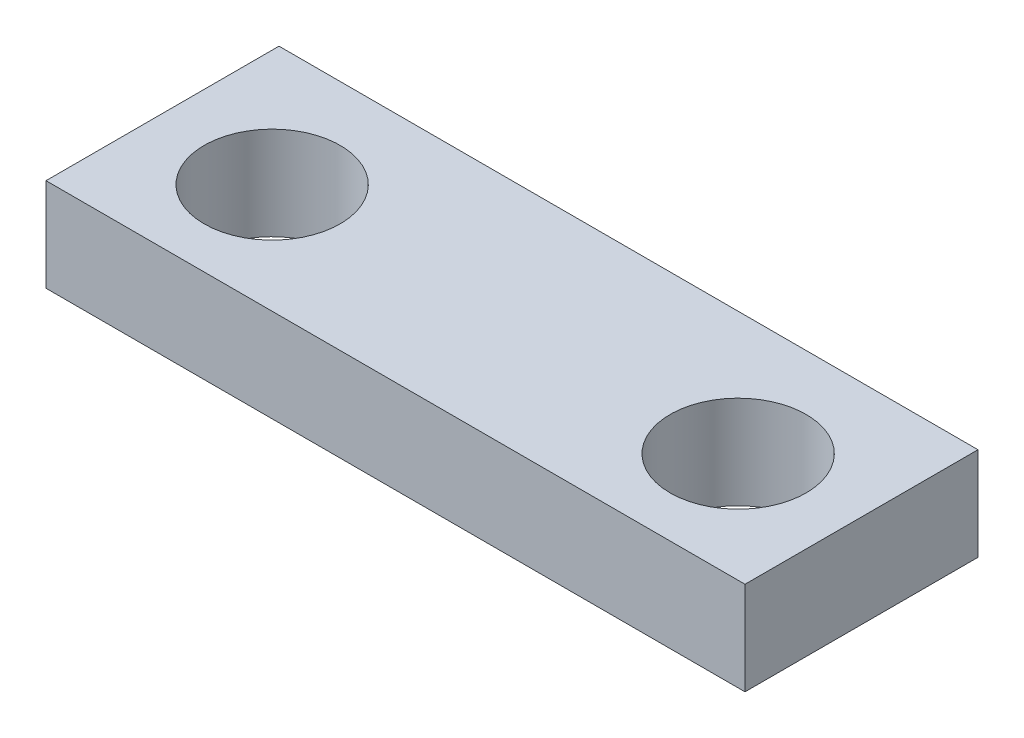
ISO-10303-21;
HEADER;
FILE_DESCRIPTION(('STEP AP214'),'2;1');
FILE_NAME('part.step','',(''),(''),'','','');
FILE_SCHEMA(('AUTOMOTIVE_DESIGN { 1 0 10303 214 1 1 1 1 }'));
ENDSEC;
DATA;
#1=APPLICATION_CONTEXT('core data for automotive mechanical design processes');
#2=APPLICATION_PROTOCOL_DEFINITION('international standard','automotive_design',2000,#1);
#3=PRODUCT_CONTEXT('',#1,'mechanical');
#4=PRODUCT('Part','Part','',(#3));
#5=PRODUCT_RELATED_PRODUCT_CATEGORY('part','',(#4));
#6=PRODUCT_DEFINITION_FORMATION('','',#4);
#7=PRODUCT_DEFINITION_CONTEXT('part definition',#1,'design');
#8=PRODUCT_DEFINITION('design','',#6,#7);
#9=PRODUCT_DEFINITION_SHAPE('','',#8);
#10=(LENGTH_UNIT() NAMED_UNIT(*) SI_UNIT(.MILLI.,.METRE.));
#11=(NAMED_UNIT(*) PLANE_ANGLE_UNIT() SI_UNIT($,.RADIAN.));
#12=(NAMED_UNIT(*) SI_UNIT($,.STERADIAN.) SOLID_ANGLE_UNIT());
#13=UNCERTAINTY_MEASURE_WITH_UNIT(LENGTH_MEASURE(1.E-05),#10,'distance_accuracy_value','');
#14=(GEOMETRIC_REPRESENTATION_CONTEXT(3) GLOBAL_UNCERTAINTY_ASSIGNED_CONTEXT((#13)) GLOBAL_UNIT_ASSIGNED_CONTEXT((#10,
#11,#12)) REPRESENTATION_CONTEXT('',''));
#15=CARTESIAN_POINT('',(0.,0.,0.));
#16=DIRECTION('',(0.,0.,1.));
#17=DIRECTION('',(1.,0.,0.));
#18=AXIS2_PLACEMENT_3D('',#15,#16,#17);
#19=CARTESIAN_POINT('',(7.94117647058824,-2.,0.));
#20=DIRECTION('',(-1.,0.,0.));
#21=DIRECTION('',(0.,0.,1.));
#22=AXIS2_PLACEMENT_3D('',#19,#20,#21);
#23=PLANE('',#22);
#24=DIRECTION('',(0.,0.,1.));
#25=VECTOR('',#24,1.);
#26=CARTESIAN_POINT('',(7.94117647058824,0.,0.));
#27=LINE('',#26,#25);
#28=CARTESIAN_POINT('',(7.94117647058824,0.,-1.76470588235294));
#29=VERTEX_POINT('',#28);
#30=CARTESIAN_POINT('',(7.94117647058824,0.,3.23529411764706));
#31=VERTEX_POINT('',#30);
#32=EDGE_CURVE('E118',#29,#31,#27,.T.);
#33=ORIENTED_EDGE('',*,*,#32,.T.);
#34=DIRECTION('',(0.,1.,0.));
#35=VECTOR('',#34,1.);
#36=CARTESIAN_POINT('',(7.94117647058824,-2.,3.23529411764706));
#37=LINE('',#36,#35);
#38=CARTESIAN_POINT('',(7.94117647058824,-2.,3.23529411764706));
#39=VERTEX_POINT('',#38);
#40=EDGE_CURVE('E11',#39,#31,#37,.T.);
#41=ORIENTED_EDGE('',*,*,#40,.F.);
#42=DIRECTION('',(0.,0.,1.));
#43=VECTOR('',#42,1.);
#44=CARTESIAN_POINT('',(7.94117647058824,-2.,0.));
#45=LINE('',#44,#43);
#46=CARTESIAN_POINT('',(7.94117647058824,-2.,-1.76470588235294));
#47=VERTEX_POINT('',#46);
#48=EDGE_CURVE('E61',#47,#39,#45,.T.);
#49=ORIENTED_EDGE('',*,*,#48,.F.);
#50=DIRECTION('',(0.,1.,0.));
#51=VECTOR('',#50,1.);
#52=CARTESIAN_POINT('',(7.94117647058824,-2.,-1.76470588235294));
#53=LINE('',#52,#51);
#54=EDGE_CURVE('E45',#47,#29,#53,.T.);
#55=ORIENTED_EDGE('',*,*,#54,.T.);
#56=EDGE_LOOP('',(#33,#41,#49,#55));
#57=FACE_BOUND('',#56,.T.);
#58=ADVANCED_FACE('F41',(#57),#23,.F.);
#59=CARTESIAN_POINT('',(0.,-2.,3.23529411764706));
#60=DIRECTION('',(0.,0.,1.));
#61=DIRECTION('',(1.,0.,0.));
#62=AXIS2_PLACEMENT_3D('',#59,#60,#61);
#63=PLANE('',#62);
#64=DIRECTION('',(1.,0.,0.));
#65=VECTOR('',#64,1.);
#66=CARTESIAN_POINT('',(0.,0.,3.23529411764706));
#67=LINE('',#66,#65);
#68=CARTESIAN_POINT('',(-7.05882352941176,0.,3.23529411764706));
#69=VERTEX_POINT('',#68);
#70=EDGE_CURVE('E126',#69,#31,#67,.T.);
#71=ORIENTED_EDGE('',*,*,#70,.F.);
#72=DIRECTION('',(0.,1.,0.));
#73=VECTOR('',#72,1.);
#74=CARTESIAN_POINT('',(-7.05882352941176,-2.,3.23529411764706));
#75=LINE('',#74,#73);
#76=CARTESIAN_POINT('',(-7.05882352941176,-2.,3.23529411764706));
#77=VERTEX_POINT('',#76);
#78=EDGE_CURVE('E52',#77,#69,#75,.T.);
#79=ORIENTED_EDGE('',*,*,#78,.F.);
#80=DIRECTION('',(1.,0.,0.));
#81=VECTOR('',#80,1.);
#82=CARTESIAN_POINT('',(0.,-2.,3.23529411764706));
#83=LINE('',#82,#81);
#84=EDGE_CURVE('E103',#77,#39,#83,.T.);
#85=ORIENTED_EDGE('',*,*,#84,.T.);
#86=ORIENTED_EDGE('',*,*,#40,.T.);
#87=EDGE_LOOP('',(#71,#79,#85,#86));
#88=FACE_BOUND('',#87,.T.);
#89=ADVANCED_FACE('F142',(#88),#63,.T.);
#90=CARTESIAN_POINT('',(-7.05882352941176,-2.,0.));
#91=DIRECTION('',(-1.,0.,0.));
#92=DIRECTION('',(0.,0.,1.));
#93=AXIS2_PLACEMENT_3D('',#90,#91,#92);
#94=PLANE('',#93);
#95=DIRECTION('',(0.,0.,1.));
#96=VECTOR('',#95,1.);
#97=CARTESIAN_POINT('',(-7.05882352941176,0.,0.));
#98=LINE('',#97,#96);
#99=CARTESIAN_POINT('',(-7.05882352941176,0.,-1.76470588235294));
#100=VERTEX_POINT('',#99);
#101=EDGE_CURVE('E93',#100,#69,#98,.T.);
#102=ORIENTED_EDGE('',*,*,#101,.F.);
#103=DIRECTION('',(0.,1.,0.));
#104=VECTOR('',#103,1.);
#105=CARTESIAN_POINT('',(-7.05882352941176,-2.,-1.76470588235294));
#106=LINE('',#105,#104);
#107=CARTESIAN_POINT('',(-7.05882352941176,-2.,-1.76470588235294));
#108=VERTEX_POINT('',#107);
#109=EDGE_CURVE('E90',#108,#100,#106,.T.);
#110=ORIENTED_EDGE('',*,*,#109,.F.);
#111=DIRECTION('',(0.,0.,1.));
#112=VECTOR('',#111,1.);
#113=CARTESIAN_POINT('',(-7.05882352941176,-2.,0.));
#114=LINE('',#113,#112);
#115=EDGE_CURVE('E92',#108,#77,#114,.T.);
#116=ORIENTED_EDGE('',*,*,#115,.T.);
#117=ORIENTED_EDGE('',*,*,#78,.T.);
#118=EDGE_LOOP('',(#102,#110,#116,#117));
#119=FACE_BOUND('',#118,.T.);
#120=ADVANCED_FACE('F91',(#119),#94,.T.);
#121=CARTESIAN_POINT('',(0.,-2.,-1.76470588235294));
#122=DIRECTION('',(0.,0.,1.));
#123=DIRECTION('',(1.,0.,0.));
#124=AXIS2_PLACEMENT_3D('',#121,#122,#123);
#125=PLANE('',#124);
#126=DIRECTION('',(1.,0.,0.));
#127=VECTOR('',#126,1.);
#128=CARTESIAN_POINT('',(0.,0.,-1.76470588235294));
#129=LINE('',#128,#127);
#130=EDGE_CURVE('E121',#100,#29,#129,.T.);
#131=ORIENTED_EDGE('',*,*,#130,.T.);
#132=ORIENTED_EDGE('',*,*,#54,.F.);
#133=DIRECTION('',(1.,0.,0.));
#134=VECTOR('',#133,1.);
#135=CARTESIAN_POINT('',(0.,-2.,-1.76470588235294));
#136=LINE('',#135,#134);
#137=EDGE_CURVE('E87',#108,#47,#136,.T.);
#138=ORIENTED_EDGE('',*,*,#137,.F.);
#139=ORIENTED_EDGE('',*,*,#109,.T.);
#140=EDGE_LOOP('',(#131,#132,#138,#139));
#141=FACE_BOUND('',#140,.T.);
#142=ADVANCED_FACE('F97',(#141),#125,.F.);
#143=CARTESIAN_POINT('',(5.44117647058824,-2.,0.882352941176473));
#144=DIRECTION('',(0.,1.,0.));
#145=DIRECTION('',(0.,0.,1.));
#146=AXIS2_PLACEMENT_3D('',#143,#144,#145);
#147=CYLINDRICAL_SURFACE('',#146,1.45951715009406);
#148=CARTESIAN_POINT('',(5.44117647058824,-2.,0.882352941176473));
#149=DIRECTION('',(0.,1.,0.));
#150=DIRECTION('',(0.,0.,1.));
#151=AXIS2_PLACEMENT_3D('',#148,#149,#150);
#152=CIRCLE('',#151,1.45951715009406);
#153=CARTESIAN_POINT('',(5.44117647058824,-2.,2.34187009127053));
#154=VERTEX_POINT('',#153);
#155=EDGE_CURVE('E133',#154,#154,#152,.T.);
#156=ORIENTED_EDGE('',*,*,#155,.F.);
#157=EDGE_LOOP('',(#156));
#158=FACE_BOUND('',#157,.T.);
#159=CARTESIAN_POINT('',(5.44117647058824,0.,0.882352941176473));
#160=DIRECTION('',(0.,1.,0.));
#161=DIRECTION('',(0.,0.,1.));
#162=AXIS2_PLACEMENT_3D('',#159,#160,#161);
#163=CIRCLE('',#162,1.45951715009406);
#164=CARTESIAN_POINT('',(5.44117647058824,0.,2.34187009127053));
#165=VERTEX_POINT('',#164);
#166=EDGE_CURVE('E114',#165,#165,#163,.T.);
#167=ORIENTED_EDGE('',*,*,#166,.T.);
#168=EDGE_LOOP('',(#167));
#169=FACE_BOUND('',#168,.T.);
#170=ADVANCED_FACE('F43',(#158,#169),#147,.F.);
#171=CARTESIAN_POINT('',(-4.55882352941176,-2.,0.882352941176473));
#172=DIRECTION('',(0.,1.,0.));
#173=DIRECTION('',(0.,0.,1.));
#174=AXIS2_PLACEMENT_3D('',#171,#172,#173);
#175=CYLINDRICAL_SURFACE('',#174,1.45951715009406);
#176=CARTESIAN_POINT('',(-4.55882352941176,-2.,0.882352941176473));
#177=DIRECTION('',(0.,1.,0.));
#178=DIRECTION('',(0.,0.,1.));
#179=AXIS2_PLACEMENT_3D('',#176,#177,#178);
#180=CIRCLE('',#179,1.45951715009406);
#181=CARTESIAN_POINT('',(-4.55882352941176,-2.,2.34187009127053));
#182=VERTEX_POINT('',#181);
#183=EDGE_CURVE('E107',#182,#182,#180,.F.);
#184=ORIENTED_EDGE('',*,*,#183,.T.);
#185=EDGE_LOOP('',(#184));
#186=FACE_BOUND('',#185,.T.);
#187=CARTESIAN_POINT('',(-4.55882352941176,0.,0.882352941176473));
#188=DIRECTION('',(0.,1.,0.));
#189=DIRECTION('',(0.,0.,1.));
#190=AXIS2_PLACEMENT_3D('',#187,#188,#189);
#191=CIRCLE('',#190,1.45951715009406);
#192=CARTESIAN_POINT('',(-4.55882352941176,0.,2.34187009127053));
#193=VERTEX_POINT('',#192);
#194=EDGE_CURVE('E130',#193,#193,#191,.F.);
#195=ORIENTED_EDGE('',*,*,#194,.F.);
#196=EDGE_LOOP('',(#195));
#197=FACE_BOUND('',#196,.T.);
#198=ADVANCED_FACE('F151',(#186,#197),#175,.F.);
#199=CARTESIAN_POINT('',(0.,-2.,0.));
#200=DIRECTION('',(0.,1.,0.));
#201=DIRECTION('',(0.,0.,1.));
#202=AXIS2_PLACEMENT_3D('',#199,#200,#201);
#203=PLANE('',#202);
#204=ORIENTED_EDGE('',*,*,#155,.T.);
#205=EDGE_LOOP('',(#204));
#206=FACE_BOUND('',#205,.T.);
#207=ORIENTED_EDGE('',*,*,#48,.T.);
#208=ORIENTED_EDGE('',*,*,#84,.F.);
#209=ORIENTED_EDGE('',*,*,#115,.F.);
#210=ORIENTED_EDGE('',*,*,#137,.T.);
#211=EDGE_LOOP('',(#207,#208,#209,#210));
#212=FACE_BOUND('',#211,.T.);
#213=ORIENTED_EDGE('',*,*,#183,.F.);
#214=EDGE_LOOP('',(#213));
#215=FACE_BOUND('',#214,.T.);
#216=ADVANCED_FACE('F101',(#206,#212,#215),#203,.F.);
#217=CARTESIAN_POINT('',(0.,0.,0.));
#218=DIRECTION('',(0.,1.,0.));
#219=DIRECTION('',(0.,0.,1.));
#220=AXIS2_PLACEMENT_3D('',#217,#218,#219);
#221=PLANE('',#220);
#222=ORIENTED_EDGE('',*,*,#166,.F.);
#223=EDGE_LOOP('',(#222));
#224=FACE_BOUND('',#223,.T.);
#225=ORIENTED_EDGE('',*,*,#32,.F.);
#226=ORIENTED_EDGE('',*,*,#130,.F.);
#227=ORIENTED_EDGE('',*,*,#101,.T.);
#228=ORIENTED_EDGE('',*,*,#70,.T.);
#229=EDGE_LOOP('',(#225,#226,#227,#228));
#230=FACE_BOUND('',#229,.T.);
#231=ORIENTED_EDGE('',*,*,#194,.T.);
#232=EDGE_LOOP('',(#231));
#233=FACE_BOUND('',#232,.T.);
#234=ADVANCED_FACE('F140',(#224,#230,#233),#221,.T.);
#235=CLOSED_SHELL('',(#58,#89,#120,#142,#170,#198,#216,#234));
#236=MANIFOLD_SOLID_BREP('B2',#235);
#237=ADVANCED_BREP_SHAPE_REPRESENTATION('',(#18,#236),#14);
#238=SHAPE_DEFINITION_REPRESENTATION(#9,#237);
ENDSEC;
END-ISO-10303-21;
